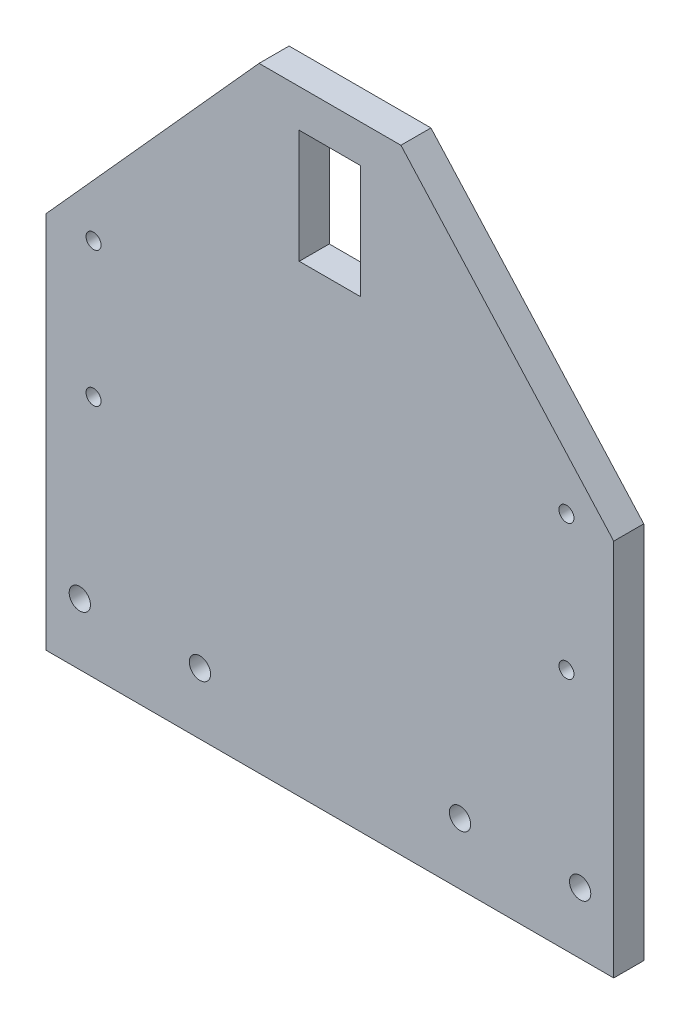
ISO-10303-21;
HEADER;
FILE_DESCRIPTION(('STEP AP214'),'2;1');
FILE_NAME('part.step','',(''),(''),'','','');
FILE_SCHEMA(('AUTOMOTIVE_DESIGN { 1 0 10303 214 1 1 1 1 }'));
ENDSEC;
DATA;
#1=APPLICATION_CONTEXT('core data for automotive mechanical design processes');
#2=APPLICATION_PROTOCOL_DEFINITION('international standard','automotive_design',2000,#1);
#3=PRODUCT_CONTEXT('',#1,'mechanical');
#4=PRODUCT('Part','Part','',(#3));
#5=PRODUCT_RELATED_PRODUCT_CATEGORY('part','',(#4));
#6=PRODUCT_DEFINITION_FORMATION('','',#4);
#7=PRODUCT_DEFINITION_CONTEXT('part definition',#1,'design');
#8=PRODUCT_DEFINITION('design','',#6,#7);
#9=PRODUCT_DEFINITION_SHAPE('','',#8);
#10=(LENGTH_UNIT() NAMED_UNIT(*) SI_UNIT(.MILLI.,.METRE.));
#11=(NAMED_UNIT(*) PLANE_ANGLE_UNIT() SI_UNIT($,.RADIAN.));
#12=(NAMED_UNIT(*) SI_UNIT($,.STERADIAN.) SOLID_ANGLE_UNIT());
#13=UNCERTAINTY_MEASURE_WITH_UNIT(LENGTH_MEASURE(1.E-05),#10,'distance_accuracy_value','');
#14=(GEOMETRIC_REPRESENTATION_CONTEXT(3) GLOBAL_UNCERTAINTY_ASSIGNED_CONTEXT((#13)) GLOBAL_UNIT_ASSIGNED_CONTEXT((#10,
#11,#12)) REPRESENTATION_CONTEXT('',''));
#15=CARTESIAN_POINT('',(0.,0.,0.));
#16=DIRECTION('',(0.,0.,1.));
#17=DIRECTION('',(1.,0.,0.));
#18=AXIS2_PLACEMENT_3D('',#15,#16,#17);
#19=CARTESIAN_POINT('',(-60.,0.,3.175));
#20=DIRECTION('',(1.,0.,0.));
#21=DIRECTION('',(0.,0.,-1.));
#22=AXIS2_PLACEMENT_3D('',#19,#20,#21);
#23=PLANE('',#22);
#24=DIRECTION('',(0.,-1.,0.));
#25=VECTOR('',#24,1.);
#26=CARTESIAN_POINT('',(-60.,0.,-3.175));
#27=LINE('',#26,#25);
#28=CARTESIAN_POINT('',(-60.,80.,-3.175));
#29=VERTEX_POINT('',#28);
#30=CARTESIAN_POINT('',(-60.,0.,-3.175));
#31=VERTEX_POINT('',#30);
#32=EDGE_CURVE('E171',#29,#31,#27,.T.);
#33=ORIENTED_EDGE('',*,*,#32,.T.);
#34=DIRECTION('',(0.,0.,-1.));
#35=VECTOR('',#34,1.);
#36=CARTESIAN_POINT('',(-60.,0.,3.175));
#37=LINE('',#36,#35);
#38=CARTESIAN_POINT('',(-60.,0.,3.175));
#39=VERTEX_POINT('',#38);
#40=EDGE_CURVE('E11',#39,#31,#37,.T.);
#41=ORIENTED_EDGE('',*,*,#40,.F.);
#42=DIRECTION('',(0.,-1.,0.));
#43=VECTOR('',#42,1.);
#44=CARTESIAN_POINT('',(-60.,0.,3.175));
#45=LINE('',#44,#43);
#46=CARTESIAN_POINT('',(-60.,80.,3.175));
#47=VERTEX_POINT('',#46);
#48=EDGE_CURVE('E174',#47,#39,#45,.T.);
#49=ORIENTED_EDGE('',*,*,#48,.F.);
#50=DIRECTION('',(0.,0.,-1.));
#51=VECTOR('',#50,1.);
#52=CARTESIAN_POINT('',(-60.,80.,3.175));
#53=LINE('',#52,#51);
#54=EDGE_CURVE('E188',#47,#29,#53,.T.);
#55=ORIENTED_EDGE('',*,*,#54,.T.);
#56=EDGE_LOOP('',(#33,#41,#49,#55));
#57=FACE_BOUND('',#56,.T.);
#58=ADVANCED_FACE('F33',(#57),#23,.F.);
#59=CARTESIAN_POINT('',(60.,0.,3.175));
#60=DIRECTION('',(0.,1.,0.));
#61=DIRECTION('',(-1.,0.,0.));
#62=AXIS2_PLACEMENT_3D('',#59,#60,#61);
#63=PLANE('',#62);
#64=DIRECTION('',(1.,0.,0.));
#65=VECTOR('',#64,1.);
#66=CARTESIAN_POINT('',(60.,0.,-3.175));
#67=LINE('',#66,#65);
#68=CARTESIAN_POINT('',(60.,0.,-3.175));
#69=VERTEX_POINT('',#68);
#70=EDGE_CURVE('E191',#31,#69,#67,.T.);
#71=ORIENTED_EDGE('',*,*,#70,.T.);
#72=DIRECTION('',(0.,0.,-1.));
#73=VECTOR('',#72,1.);
#74=CARTESIAN_POINT('',(60.,0.,3.175));
#75=LINE('',#74,#73);
#76=CARTESIAN_POINT('',(60.,0.,3.175));
#77=VERTEX_POINT('',#76);
#78=EDGE_CURVE('E40',#77,#69,#75,.T.);
#79=ORIENTED_EDGE('',*,*,#78,.F.);
#80=DIRECTION('',(1.,0.,0.));
#81=VECTOR('',#80,1.);
#82=CARTESIAN_POINT('',(60.,0.,3.175));
#83=LINE('',#82,#81);
#84=EDGE_CURVE('E177',#39,#77,#83,.T.);
#85=ORIENTED_EDGE('',*,*,#84,.F.);
#86=ORIENTED_EDGE('',*,*,#40,.T.);
#87=EDGE_LOOP('',(#71,#79,#85,#86));
#88=FACE_BOUND('',#87,.T.);
#89=ADVANCED_FACE('F237',(#88),#63,.F.);
#90=CARTESIAN_POINT('',(60.,0.,3.175));
#91=DIRECTION('',(-1.,0.,0.));
#92=DIRECTION('',(0.,-1.,0.));
#93=AXIS2_PLACEMENT_3D('',#90,#91,#92);
#94=PLANE('',#93);
#95=DIRECTION('',(0.,1.,0.));
#96=VECTOR('',#95,1.);
#97=CARTESIAN_POINT('',(60.,0.,-3.175));
#98=LINE('',#97,#96);
#99=CARTESIAN_POINT('',(60.,80.,-3.175));
#100=VERTEX_POINT('',#99);
#101=EDGE_CURVE('E193',#69,#100,#98,.T.);
#102=ORIENTED_EDGE('',*,*,#101,.T.);
#103=DIRECTION('',(0.,0.,-1.));
#104=VECTOR('',#103,1.);
#105=CARTESIAN_POINT('',(60.,80.,3.175));
#106=LINE('',#105,#104);
#107=CARTESIAN_POINT('',(60.,80.,3.175));
#108=VERTEX_POINT('',#107);
#109=EDGE_CURVE('E208',#108,#100,#106,.T.);
#110=ORIENTED_EDGE('',*,*,#109,.F.);
#111=DIRECTION('',(0.,1.,0.));
#112=VECTOR('',#111,1.);
#113=CARTESIAN_POINT('',(60.,0.,3.175));
#114=LINE('',#113,#112);
#115=EDGE_CURVE('E180',#77,#108,#114,.T.);
#116=ORIENTED_EDGE('',*,*,#115,.F.);
#117=ORIENTED_EDGE('',*,*,#78,.T.);
#118=EDGE_LOOP('',(#102,#110,#116,#117));
#119=FACE_BOUND('',#118,.T.);
#120=ADVANCED_FACE('F215',(#119),#94,.F.);
#121=CARTESIAN_POINT('',(60.,80.,3.175));
#122=DIRECTION('',(-0.743294146247166,-0.66896473162245,0.));
#123=DIRECTION('',(0.66896473162245,-0.743294146247166,0.));
#124=AXIS2_PLACEMENT_3D('',#121,#122,#123);
#125=PLANE('',#124);
#126=DIRECTION('',(-0.66896473162245,0.743294146247166,0.));
#127=VECTOR('',#126,1.);
#128=CARTESIAN_POINT('',(60.,80.,-3.175));
#129=LINE('',#128,#127);
#130=CARTESIAN_POINT('',(15.,130.,-3.175));
#131=VERTEX_POINT('',#130);
#132=EDGE_CURVE('E195',#100,#131,#129,.T.);
#133=ORIENTED_EDGE('',*,*,#132,.T.);
#134=DIRECTION('',(0.,0.,-1.));
#135=VECTOR('',#134,1.);
#136=CARTESIAN_POINT('',(15.,130.,3.175));
#137=LINE('',#136,#135);
#138=CARTESIAN_POINT('',(15.,130.,3.175));
#139=VERTEX_POINT('',#138);
#140=EDGE_CURVE('E205',#139,#131,#137,.T.);
#141=ORIENTED_EDGE('',*,*,#140,.F.);
#142=DIRECTION('',(-0.66896473162245,0.743294146247166,0.));
#143=VECTOR('',#142,1.);
#144=CARTESIAN_POINT('',(60.,80.,3.175));
#145=LINE('',#144,#143);
#146=EDGE_CURVE('E182',#108,#139,#145,.T.);
#147=ORIENTED_EDGE('',*,*,#146,.F.);
#148=ORIENTED_EDGE('',*,*,#109,.T.);
#149=EDGE_LOOP('',(#133,#141,#147,#148));
#150=FACE_BOUND('',#149,.T.);
#151=ADVANCED_FACE('F225',(#150),#125,.F.);
#152=CARTESIAN_POINT('',(15.,130.,3.175));
#153=DIRECTION('',(0.,-1.,0.));
#154=DIRECTION('',(0.,0.,-1.));
#155=AXIS2_PLACEMENT_3D('',#152,#153,#154);
#156=PLANE('',#155);
#157=DIRECTION('',(-1.,0.,0.));
#158=VECTOR('',#157,1.);
#159=CARTESIAN_POINT('',(15.,130.,-3.175));
#160=LINE('',#159,#158);
#161=CARTESIAN_POINT('',(-15.,130.,-3.175));
#162=VERTEX_POINT('',#161);
#163=EDGE_CURVE('E197',#131,#162,#160,.T.);
#164=ORIENTED_EDGE('',*,*,#163,.T.);
#165=DIRECTION('',(0.,0.,-1.));
#166=VECTOR('',#165,1.);
#167=CARTESIAN_POINT('',(-15.,130.,3.175));
#168=LINE('',#167,#166);
#169=CARTESIAN_POINT('',(-15.,130.,3.175));
#170=VERTEX_POINT('',#169);
#171=EDGE_CURVE('E202',#170,#162,#168,.T.);
#172=ORIENTED_EDGE('',*,*,#171,.F.);
#173=DIRECTION('',(-1.,0.,0.));
#174=VECTOR('',#173,1.);
#175=CARTESIAN_POINT('',(15.,130.,3.175));
#176=LINE('',#175,#174);
#177=EDGE_CURVE('E184',#139,#170,#176,.T.);
#178=ORIENTED_EDGE('',*,*,#177,.F.);
#179=ORIENTED_EDGE('',*,*,#140,.T.);
#180=EDGE_LOOP('',(#164,#172,#178,#179));
#181=FACE_BOUND('',#180,.T.);
#182=ADVANCED_FACE('F229',(#181),#156,.F.);
#183=CARTESIAN_POINT('',(-15.,130.,3.175));
#184=DIRECTION('',(0.743294146247166,-0.66896473162245,0.));
#185=DIRECTION('',(0.66896473162245,0.743294146247166,0.));
#186=AXIS2_PLACEMENT_3D('',#183,#184,#185);
#187=PLANE('',#186);
#188=DIRECTION('',(-0.66896473162245,-0.743294146247166,0.));
#189=VECTOR('',#188,1.);
#190=CARTESIAN_POINT('',(-15.,130.,-3.175));
#191=LINE('',#190,#189);
#192=EDGE_CURVE('E178',#162,#29,#191,.T.);
#193=ORIENTED_EDGE('',*,*,#192,.T.);
#194=ORIENTED_EDGE('',*,*,#54,.F.);
#195=DIRECTION('',(-0.66896473162245,-0.743294146247166,0.));
#196=VECTOR('',#195,1.);
#197=CARTESIAN_POINT('',(-15.,130.,3.175));
#198=LINE('',#197,#196);
#199=EDGE_CURVE('E186',#170,#47,#198,.T.);
#200=ORIENTED_EDGE('',*,*,#199,.F.);
#201=ORIENTED_EDGE('',*,*,#171,.T.);
#202=EDGE_LOOP('',(#193,#194,#200,#201));
#203=FACE_BOUND('',#202,.T.);
#204=ADVANCED_FACE('F240',(#203),#187,.F.);
#205=CARTESIAN_POINT('',(0.,0.,3.175));
#206=DIRECTION('',(0.,0.,1.));
#207=DIRECTION('',(1.,0.,0.));
#208=AXIS2_PLACEMENT_3D('',#205,#206,#207);
#209=PLANE('',#208);
#210=CARTESIAN_POINT('',(50.,80.,3.175));
#211=DIRECTION('',(0.,0.,1.));
#212=DIRECTION('',(-1.,0.,0.));
#213=AXIS2_PLACEMENT_3D('',#210,#211,#212);
#214=CIRCLE('',#213,1.5875);
#215=CARTESIAN_POINT('',(48.4125,80.,3.175));
#216=VERTEX_POINT('',#215);
#217=EDGE_CURVE('E412',#216,#216,#214,.T.);
#218=ORIENTED_EDGE('',*,*,#217,.F.);
#219=EDGE_LOOP('',(#218));
#220=FACE_BOUND('',#219,.T.);
#221=CARTESIAN_POINT('',(50.,51.425,3.175));
#222=DIRECTION('',(0.,0.,1.));
#223=DIRECTION('',(-1.,0.,0.));
#224=AXIS2_PLACEMENT_3D('',#221,#222,#223);
#225=CIRCLE('',#224,1.5875);
#226=CARTESIAN_POINT('',(48.4125,51.425,3.175));
#227=VERTEX_POINT('',#226);
#228=EDGE_CURVE('E414',#227,#227,#225,.T.);
#229=ORIENTED_EDGE('',*,*,#228,.F.);
#230=EDGE_LOOP('',(#229));
#231=FACE_BOUND('',#230,.T.);
#232=CARTESIAN_POINT('',(-50.,51.425,3.175));
#233=DIRECTION('',(0.,0.,1.));
#234=DIRECTION('',(1.,0.,0.));
#235=AXIS2_PLACEMENT_3D('',#232,#233,#234);
#236=CIRCLE('',#235,1.5875);
#237=CARTESIAN_POINT('',(-48.4125,51.425,3.175));
#238=VERTEX_POINT('',#237);
#239=EDGE_CURVE('E420',#238,#238,#236,.T.);
#240=ORIENTED_EDGE('',*,*,#239,.F.);
#241=EDGE_LOOP('',(#240));
#242=FACE_BOUND('',#241,.T.);
#243=CARTESIAN_POINT('',(-50.,80.,3.175));
#244=DIRECTION('',(0.,0.,1.));
#245=DIRECTION('',(1.,0.,0.));
#246=AXIS2_PLACEMENT_3D('',#243,#244,#245);
#247=CIRCLE('',#246,1.5875);
#248=CARTESIAN_POINT('',(-48.4125,80.,3.175));
#249=VERTEX_POINT('',#248);
#250=EDGE_CURVE('E133',#249,#249,#247,.T.);
#251=ORIENTED_EDGE('',*,*,#250,.F.);
#252=EDGE_LOOP('',(#251));
#253=FACE_BOUND('',#252,.T.);
#254=DIRECTION('',(0.,1.,0.));
#255=VECTOR('',#254,1.);
#256=CARTESIAN_POINT('',(6.5,98.,3.175));
#257=LINE('',#256,#255);
#258=CARTESIAN_POINT('',(6.5,98.,3.175));
#259=VERTEX_POINT('',#258);
#260=CARTESIAN_POINT('',(6.5,122.,3.175));
#261=VERTEX_POINT('',#260);
#262=EDGE_CURVE('E47',#259,#261,#257,.T.);
#263=ORIENTED_EDGE('',*,*,#262,.F.);
#264=DIRECTION('',(1.,0.,0.));
#265=VECTOR('',#264,1.);
#266=CARTESIAN_POINT('',(-6.5,98.,3.175));
#267=LINE('',#266,#265);
#268=CARTESIAN_POINT('',(-6.5,98.,3.175));
#269=VERTEX_POINT('',#268);
#270=EDGE_CURVE('E127',#269,#259,#267,.T.);
#271=ORIENTED_EDGE('',*,*,#270,.F.);
#272=DIRECTION('',(0.,-1.,0.));
#273=VECTOR('',#272,1.);
#274=CARTESIAN_POINT('',(-6.5,98.,3.175));
#275=LINE('',#274,#273);
#276=CARTESIAN_POINT('',(-6.5,122.,3.175));
#277=VERTEX_POINT('',#276);
#278=EDGE_CURVE('E130',#277,#269,#275,.T.);
#279=ORIENTED_EDGE('',*,*,#278,.F.);
#280=DIRECTION('',(-1.,0.,0.));
#281=VECTOR('',#280,1.);
#282=CARTESIAN_POINT('',(-6.5,122.,3.175));
#283=LINE('',#282,#281);
#284=EDGE_CURVE('E139',#261,#277,#283,.T.);
#285=ORIENTED_EDGE('',*,*,#284,.F.);
#286=EDGE_LOOP('',(#263,#271,#279,#285));
#287=FACE_BOUND('',#286,.T.);
#288=CARTESIAN_POINT('',(52.9,13.,3.175));
#289=DIRECTION('',(0.,0.,1.));
#290=DIRECTION('',(-1.,0.,0.));
#291=AXIS2_PLACEMENT_3D('',#288,#289,#290);
#292=CIRCLE('',#291,2.25);
#293=CARTESIAN_POINT('',(50.65,13.,3.175));
#294=VERTEX_POINT('',#293);
#295=EDGE_CURVE('E146',#294,#294,#292,.T.);
#296=ORIENTED_EDGE('',*,*,#295,.F.);
#297=EDGE_LOOP('',(#296));
#298=FACE_BOUND('',#297,.T.);
#299=CARTESIAN_POINT('',(27.5,13.,3.175));
#300=DIRECTION('',(0.,0.,1.));
#301=DIRECTION('',(-1.,0.,0.));
#302=AXIS2_PLACEMENT_3D('',#299,#300,#301);
#303=CIRCLE('',#302,2.25);
#304=CARTESIAN_POINT('',(25.25,13.,3.175));
#305=VERTEX_POINT('',#304);
#306=EDGE_CURVE('E153',#305,#305,#303,.T.);
#307=ORIENTED_EDGE('',*,*,#306,.F.);
#308=EDGE_LOOP('',(#307));
#309=FACE_BOUND('',#308,.T.);
#310=CARTESIAN_POINT('',(-27.5,13.,3.175));
#311=DIRECTION('',(0.,0.,1.));
#312=DIRECTION('',(1.,0.,0.));
#313=AXIS2_PLACEMENT_3D('',#310,#311,#312);
#314=CIRCLE('',#313,2.25);
#315=CARTESIAN_POINT('',(-25.25,13.,3.175));
#316=VERTEX_POINT('',#315);
#317=EDGE_CURVE('E159',#316,#316,#314,.T.);
#318=ORIENTED_EDGE('',*,*,#317,.F.);
#319=EDGE_LOOP('',(#318));
#320=FACE_BOUND('',#319,.T.);
#321=CARTESIAN_POINT('',(-52.9,13.,3.175));
#322=DIRECTION('',(0.,0.,1.));
#323=DIRECTION('',(1.,0.,0.));
#324=AXIS2_PLACEMENT_3D('',#321,#322,#323);
#325=CIRCLE('',#324,2.25);
#326=CARTESIAN_POINT('',(-50.65,13.,3.175));
#327=VERTEX_POINT('',#326);
#328=EDGE_CURVE('E165',#327,#327,#325,.T.);
#329=ORIENTED_EDGE('',*,*,#328,.F.);
#330=EDGE_LOOP('',(#329));
#331=FACE_BOUND('',#330,.T.);
#332=ORIENTED_EDGE('',*,*,#48,.T.);
#333=ORIENTED_EDGE('',*,*,#84,.T.);
#334=ORIENTED_EDGE('',*,*,#115,.T.);
#335=ORIENTED_EDGE('',*,*,#146,.T.);
#336=ORIENTED_EDGE('',*,*,#177,.T.);
#337=ORIENTED_EDGE('',*,*,#199,.T.);
#338=EDGE_LOOP('',(#332,#333,#334,#335,#336,#337));
#339=FACE_BOUND('',#338,.T.);
#340=ADVANCED_FACE('F233',(#220,#231,#242,#253,#287,#298,#309,#320,#331,#339),#209,.T.);
#341=CARTESIAN_POINT('',(0.,0.,-3.175));
#342=DIRECTION('',(0.,0.,1.));
#343=DIRECTION('',(1.,0.,0.));
#344=AXIS2_PLACEMENT_3D('',#341,#342,#343);
#345=PLANE('',#344);
#346=CARTESIAN_POINT('',(50.,80.,-3.175));
#347=DIRECTION('',(0.,0.,1.));
#348=DIRECTION('',(-1.,0.,0.));
#349=AXIS2_PLACEMENT_3D('',#346,#347,#348);
#350=CIRCLE('',#349,1.5875);
#351=CARTESIAN_POINT('',(48.4125,80.,-3.175));
#352=VERTEX_POINT('',#351);
#353=EDGE_CURVE('E409',#352,#352,#350,.T.);
#354=ORIENTED_EDGE('',*,*,#353,.T.);
#355=EDGE_LOOP('',(#354));
#356=FACE_BOUND('',#355,.T.);
#357=CARTESIAN_POINT('',(50.,51.425,-3.175));
#358=DIRECTION('',(0.,0.,1.));
#359=DIRECTION('',(-1.,0.,0.));
#360=AXIS2_PLACEMENT_3D('',#357,#358,#359);
#361=CIRCLE('',#360,1.5875);
#362=CARTESIAN_POINT('',(48.4125,51.425,-3.175));
#363=VERTEX_POINT('',#362);
#364=EDGE_CURVE('E417',#363,#363,#361,.T.);
#365=ORIENTED_EDGE('',*,*,#364,.T.);
#366=EDGE_LOOP('',(#365));
#367=FACE_BOUND('',#366,.T.);
#368=CARTESIAN_POINT('',(-50.,51.425,-3.175));
#369=DIRECTION('',(0.,0.,1.));
#370=DIRECTION('',(1.,0.,0.));
#371=AXIS2_PLACEMENT_3D('',#368,#369,#370);
#372=CIRCLE('',#371,1.5875);
#373=CARTESIAN_POINT('',(-48.4125,51.425,-3.175));
#374=VERTEX_POINT('',#373);
#375=EDGE_CURVE('E423',#374,#374,#372,.T.);
#376=ORIENTED_EDGE('',*,*,#375,.T.);
#377=EDGE_LOOP('',(#376));
#378=FACE_BOUND('',#377,.T.);
#379=CARTESIAN_POINT('',(-50.,80.,-3.175));
#380=DIRECTION('',(0.,0.,1.));
#381=DIRECTION('',(1.,0.,0.));
#382=AXIS2_PLACEMENT_3D('',#379,#380,#381);
#383=CIRCLE('',#382,1.5875);
#384=CARTESIAN_POINT('',(-48.4125,80.,-3.175));
#385=VERTEX_POINT('',#384);
#386=EDGE_CURVE('E140',#385,#385,#383,.T.);
#387=ORIENTED_EDGE('',*,*,#386,.T.);
#388=EDGE_LOOP('',(#387));
#389=FACE_BOUND('',#388,.T.);
#390=DIRECTION('',(1.,0.,0.));
#391=VECTOR('',#390,1.);
#392=CARTESIAN_POINT('',(-6.5,98.,-3.175));
#393=LINE('',#392,#391);
#394=CARTESIAN_POINT('',(-6.5,98.,-3.175));
#395=VERTEX_POINT('',#394);
#396=CARTESIAN_POINT('',(6.5,98.,-3.175));
#397=VERTEX_POINT('',#396);
#398=EDGE_CURVE('E117',#395,#397,#393,.T.);
#399=ORIENTED_EDGE('',*,*,#398,.T.);
#400=DIRECTION('',(0.,1.,0.));
#401=VECTOR('',#400,1.);
#402=CARTESIAN_POINT('',(6.5,98.,-3.175));
#403=LINE('',#402,#401);
#404=CARTESIAN_POINT('',(6.5,122.,-3.175));
#405=VERTEX_POINT('',#404);
#406=EDGE_CURVE('E111',#397,#405,#403,.T.);
#407=ORIENTED_EDGE('',*,*,#406,.T.);
#408=DIRECTION('',(-1.,0.,0.));
#409=VECTOR('',#408,1.);
#410=CARTESIAN_POINT('',(-6.5,122.,-3.175));
#411=LINE('',#410,#409);
#412=CARTESIAN_POINT('',(-6.5,122.,-3.175));
#413=VERTEX_POINT('',#412);
#414=EDGE_CURVE('E120',#405,#413,#411,.T.);
#415=ORIENTED_EDGE('',*,*,#414,.T.);
#416=DIRECTION('',(0.,-1.,0.));
#417=VECTOR('',#416,1.);
#418=CARTESIAN_POINT('',(-6.5,98.,-3.175));
#419=LINE('',#418,#417);
#420=EDGE_CURVE('E55',#413,#395,#419,.T.);
#421=ORIENTED_EDGE('',*,*,#420,.T.);
#422=EDGE_LOOP('',(#399,#407,#415,#421));
#423=FACE_BOUND('',#422,.T.);
#424=CARTESIAN_POINT('',(52.9,13.,-3.175));
#425=DIRECTION('',(0.,0.,1.));
#426=DIRECTION('',(-1.,0.,0.));
#427=AXIS2_PLACEMENT_3D('',#424,#425,#426);
#428=CIRCLE('',#427,2.25);
#429=CARTESIAN_POINT('',(50.65,13.,-3.175));
#430=VERTEX_POINT('',#429);
#431=EDGE_CURVE('E150',#430,#430,#428,.T.);
#432=ORIENTED_EDGE('',*,*,#431,.T.);
#433=EDGE_LOOP('',(#432));
#434=FACE_BOUND('',#433,.T.);
#435=CARTESIAN_POINT('',(27.5,13.,-3.175));
#436=DIRECTION('',(0.,0.,1.));
#437=DIRECTION('',(-1.,0.,0.));
#438=AXIS2_PLACEMENT_3D('',#435,#436,#437);
#439=CIRCLE('',#438,2.25);
#440=CARTESIAN_POINT('',(25.25,13.,-3.175));
#441=VERTEX_POINT('',#440);
#442=EDGE_CURVE('E156',#441,#441,#439,.T.);
#443=ORIENTED_EDGE('',*,*,#442,.T.);
#444=EDGE_LOOP('',(#443));
#445=FACE_BOUND('',#444,.T.);
#446=CARTESIAN_POINT('',(-27.5,13.,-3.175));
#447=DIRECTION('',(0.,0.,1.));
#448=DIRECTION('',(1.,0.,0.));
#449=AXIS2_PLACEMENT_3D('',#446,#447,#448);
#450=CIRCLE('',#449,2.25);
#451=CARTESIAN_POINT('',(-25.25,13.,-3.175));
#452=VERTEX_POINT('',#451);
#453=EDGE_CURVE('E162',#452,#452,#450,.T.);
#454=ORIENTED_EDGE('',*,*,#453,.T.);
#455=EDGE_LOOP('',(#454));
#456=FACE_BOUND('',#455,.T.);
#457=CARTESIAN_POINT('',(-52.9,13.,-3.175));
#458=DIRECTION('',(0.,0.,1.));
#459=DIRECTION('',(1.,0.,0.));
#460=AXIS2_PLACEMENT_3D('',#457,#458,#459);
#461=CIRCLE('',#460,2.25);
#462=CARTESIAN_POINT('',(-50.65,13.,-3.175));
#463=VERTEX_POINT('',#462);
#464=EDGE_CURVE('E168',#463,#463,#461,.T.);
#465=ORIENTED_EDGE('',*,*,#464,.T.);
#466=EDGE_LOOP('',(#465));
#467=FACE_BOUND('',#466,.T.);
#468=ORIENTED_EDGE('',*,*,#32,.F.);
#469=ORIENTED_EDGE('',*,*,#192,.F.);
#470=ORIENTED_EDGE('',*,*,#163,.F.);
#471=ORIENTED_EDGE('',*,*,#132,.F.);
#472=ORIENTED_EDGE('',*,*,#101,.F.);
#473=ORIENTED_EDGE('',*,*,#70,.F.);
#474=EDGE_LOOP('',(#468,#469,#470,#471,#472,#473));
#475=FACE_BOUND('',#474,.T.);
#476=ADVANCED_FACE('F124',(#356,#367,#378,#389,#423,#434,#445,#456,#467,#475),#345,.F.);
#477=CARTESIAN_POINT('',(-52.9,13.,-3.175));
#478=DIRECTION('',(0.,0.,1.));
#479=DIRECTION('',(1.,0.,0.));
#480=AXIS2_PLACEMENT_3D('',#477,#478,#479);
#481=CYLINDRICAL_SURFACE('',#480,2.25);
#482=ORIENTED_EDGE('',*,*,#464,.F.);
#483=EDGE_LOOP('',(#482));
#484=FACE_BOUND('',#483,.T.);
#485=ORIENTED_EDGE('',*,*,#328,.T.);
#486=EDGE_LOOP('',(#485));
#487=FACE_BOUND('',#486,.T.);
#488=ADVANCED_FACE('F288',(#484,#487),#481,.F.);
#489=CARTESIAN_POINT('',(-27.5,13.,-3.175));
#490=DIRECTION('',(0.,0.,1.));
#491=DIRECTION('',(1.,0.,0.));
#492=AXIS2_PLACEMENT_3D('',#489,#490,#491);
#493=CYLINDRICAL_SURFACE('',#492,2.25);
#494=ORIENTED_EDGE('',*,*,#453,.F.);
#495=EDGE_LOOP('',(#494));
#496=FACE_BOUND('',#495,.T.);
#497=ORIENTED_EDGE('',*,*,#317,.T.);
#498=EDGE_LOOP('',(#497));
#499=FACE_BOUND('',#498,.T.);
#500=ADVANCED_FACE('F297',(#496,#499),#493,.F.);
#501=CARTESIAN_POINT('',(27.5,13.,-3.175));
#502=DIRECTION('',(0.,0.,1.));
#503=DIRECTION('',(1.,0.,0.));
#504=AXIS2_PLACEMENT_3D('',#501,#502,#503);
#505=CYLINDRICAL_SURFACE('',#504,2.25);
#506=ORIENTED_EDGE('',*,*,#442,.F.);
#507=EDGE_LOOP('',(#506));
#508=FACE_BOUND('',#507,.T.);
#509=ORIENTED_EDGE('',*,*,#306,.T.);
#510=EDGE_LOOP('',(#509));
#511=FACE_BOUND('',#510,.T.);
#512=ADVANCED_FACE('F307',(#508,#511),#505,.F.);
#513=CARTESIAN_POINT('',(52.9,13.,-3.175));
#514=DIRECTION('',(0.,0.,1.));
#515=DIRECTION('',(1.,0.,0.));
#516=AXIS2_PLACEMENT_3D('',#513,#514,#515);
#517=CYLINDRICAL_SURFACE('',#516,2.25);
#518=ORIENTED_EDGE('',*,*,#431,.F.);
#519=EDGE_LOOP('',(#518));
#520=FACE_BOUND('',#519,.T.);
#521=ORIENTED_EDGE('',*,*,#295,.T.);
#522=EDGE_LOOP('',(#521));
#523=FACE_BOUND('',#522,.T.);
#524=ADVANCED_FACE('F317',(#520,#523),#517,.F.);
#525=CARTESIAN_POINT('',(6.5,98.,-3.175));
#526=DIRECTION('',(1.,0.,0.));
#527=DIRECTION('',(0.,0.,-1.));
#528=AXIS2_PLACEMENT_3D('',#525,#526,#527);
#529=PLANE('',#528);
#530=ORIENTED_EDGE('',*,*,#262,.T.);
#531=DIRECTION('',(0.,0.,1.));
#532=VECTOR('',#531,1.);
#533=CARTESIAN_POINT('',(6.5,122.,-3.175));
#534=LINE('',#533,#532);
#535=EDGE_CURVE('E107',#405,#261,#534,.T.);
#536=ORIENTED_EDGE('',*,*,#535,.F.);
#537=ORIENTED_EDGE('',*,*,#406,.F.);
#538=DIRECTION('',(0.,0.,1.));
#539=VECTOR('',#538,1.);
#540=CARTESIAN_POINT('',(6.5,98.,-3.175));
#541=LINE('',#540,#539);
#542=EDGE_CURVE('E144',#397,#259,#541,.T.);
#543=ORIENTED_EDGE('',*,*,#542,.T.);
#544=EDGE_LOOP('',(#530,#536,#537,#543));
#545=FACE_BOUND('',#544,.T.);
#546=ADVANCED_FACE('F109',(#545),#529,.F.);
#547=CARTESIAN_POINT('',(-6.5,98.,-3.175));
#548=DIRECTION('',(0.,-1.,0.));
#549=DIRECTION('',(0.,0.,-1.));
#550=AXIS2_PLACEMENT_3D('',#547,#548,#549);
#551=PLANE('',#550);
#552=ORIENTED_EDGE('',*,*,#270,.T.);
#553=ORIENTED_EDGE('',*,*,#542,.F.);
#554=ORIENTED_EDGE('',*,*,#398,.F.);
#555=DIRECTION('',(0.,0.,1.));
#556=VECTOR('',#555,1.);
#557=CARTESIAN_POINT('',(-6.5,98.,-3.175));
#558=LINE('',#557,#556);
#559=EDGE_CURVE('E147',#395,#269,#558,.T.);
#560=ORIENTED_EDGE('',*,*,#559,.T.);
#561=EDGE_LOOP('',(#552,#553,#554,#560));
#562=FACE_BOUND('',#561,.T.);
#563=ADVANCED_FACE('F336',(#562),#551,.F.);
#564=CARTESIAN_POINT('',(-6.5,98.,-3.175));
#565=DIRECTION('',(-1.,0.,0.));
#566=DIRECTION('',(0.,0.,1.));
#567=AXIS2_PLACEMENT_3D('',#564,#565,#566);
#568=PLANE('',#567);
#569=ORIENTED_EDGE('',*,*,#278,.T.);
#570=ORIENTED_EDGE('',*,*,#559,.F.);
#571=ORIENTED_EDGE('',*,*,#420,.F.);
#572=DIRECTION('',(0.,0.,1.));
#573=VECTOR('',#572,1.);
#574=CARTESIAN_POINT('',(-6.5,122.,-3.175));
#575=LINE('',#574,#573);
#576=EDGE_CURVE('E116',#413,#277,#575,.T.);
#577=ORIENTED_EDGE('',*,*,#576,.T.);
#578=EDGE_LOOP('',(#569,#570,#571,#577));
#579=FACE_BOUND('',#578,.T.);
#580=ADVANCED_FACE('F345',(#579),#568,.F.);
#581=CARTESIAN_POINT('',(-6.5,122.,-3.175));
#582=DIRECTION('',(0.,1.,0.));
#583=DIRECTION('',(0.,0.,1.));
#584=AXIS2_PLACEMENT_3D('',#581,#582,#583);
#585=PLANE('',#584);
#586=ORIENTED_EDGE('',*,*,#284,.T.);
#587=ORIENTED_EDGE('',*,*,#576,.F.);
#588=ORIENTED_EDGE('',*,*,#414,.F.);
#589=ORIENTED_EDGE('',*,*,#535,.T.);
#590=EDGE_LOOP('',(#586,#587,#588,#589));
#591=FACE_BOUND('',#590,.T.);
#592=ADVANCED_FACE('F121',(#591),#585,.F.);
#593=CARTESIAN_POINT('',(-50.,80.,-3.175));
#594=DIRECTION('',(0.,0.,1.));
#595=DIRECTION('',(1.,0.,0.));
#596=AXIS2_PLACEMENT_3D('',#593,#594,#595);
#597=CYLINDRICAL_SURFACE('',#596,1.5875);
#598=ORIENTED_EDGE('',*,*,#386,.F.);
#599=EDGE_LOOP('',(#598));
#600=FACE_BOUND('',#599,.T.);
#601=ORIENTED_EDGE('',*,*,#250,.T.);
#602=EDGE_LOOP('',(#601));
#603=FACE_BOUND('',#602,.T.);
#604=ADVANCED_FACE('F363',(#600,#603),#597,.F.);
#605=CARTESIAN_POINT('',(-50.,51.425,-3.175));
#606=DIRECTION('',(0.,0.,1.));
#607=DIRECTION('',(1.,0.,0.));
#608=AXIS2_PLACEMENT_3D('',#605,#606,#607);
#609=CYLINDRICAL_SURFACE('',#608,1.5875);
#610=ORIENTED_EDGE('',*,*,#375,.F.);
#611=EDGE_LOOP('',(#610));
#612=FACE_BOUND('',#611,.T.);
#613=ORIENTED_EDGE('',*,*,#239,.T.);
#614=EDGE_LOOP('',(#613));
#615=FACE_BOUND('',#614,.T.);
#616=ADVANCED_FACE('F372',(#612,#615),#609,.F.);
#617=CARTESIAN_POINT('',(50.,51.425,-3.175));
#618=DIRECTION('',(0.,0.,1.));
#619=DIRECTION('',(1.,0.,0.));
#620=AXIS2_PLACEMENT_3D('',#617,#618,#619);
#621=CYLINDRICAL_SURFACE('',#620,1.5875);
#622=ORIENTED_EDGE('',*,*,#364,.F.);
#623=EDGE_LOOP('',(#622));
#624=FACE_BOUND('',#623,.T.);
#625=ORIENTED_EDGE('',*,*,#228,.T.);
#626=EDGE_LOOP('',(#625));
#627=FACE_BOUND('',#626,.T.);
#628=ADVANCED_FACE('F382',(#624,#627),#621,.F.);
#629=CARTESIAN_POINT('',(50.,80.,-3.175));
#630=DIRECTION('',(0.,0.,1.));
#631=DIRECTION('',(1.,0.,0.));
#632=AXIS2_PLACEMENT_3D('',#629,#630,#631);
#633=CYLINDRICAL_SURFACE('',#632,1.5875);
#634=ORIENTED_EDGE('',*,*,#353,.F.);
#635=EDGE_LOOP('',(#634));
#636=FACE_BOUND('',#635,.T.);
#637=ORIENTED_EDGE('',*,*,#217,.T.);
#638=EDGE_LOOP('',(#637));
#639=FACE_BOUND('',#638,.T.);
#640=ADVANCED_FACE('F392',(#636,#639),#633,.F.);
#641=CLOSED_SHELL('',(#58,#89,#120,#151,#182,#204,#340,#476,#488,#500,#512,#524,#546,#563,#580,
#592,#604,#616,#628,#640));
#642=MANIFOLD_SOLID_BREP('B2',#641);
#643=ADVANCED_BREP_SHAPE_REPRESENTATION('',(#18,#642),#14);
#644=SHAPE_DEFINITION_REPRESENTATION(#9,#643);
ENDSEC;
END-ISO-10303-21;
